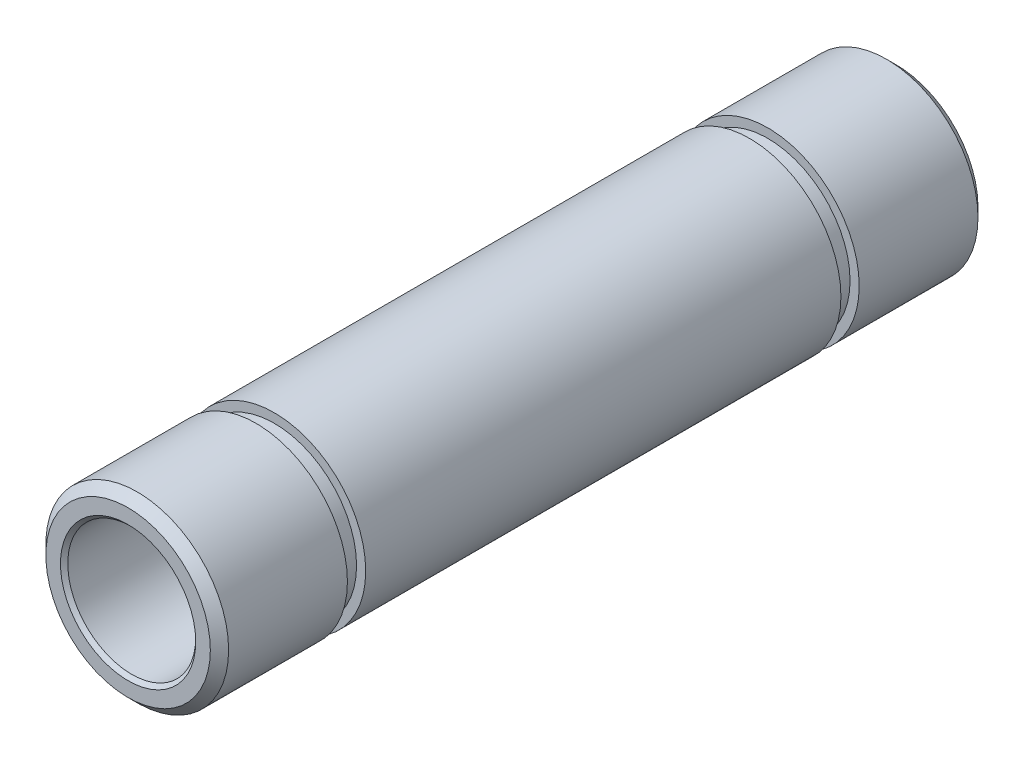
ISO-10303-21;
HEADER;
FILE_DESCRIPTION(('STEP AP214'),'2;1');
FILE_NAME('part.step','',(''),(''),'','','');
FILE_SCHEMA(('AUTOMOTIVE_DESIGN { 1 0 10303 214 1 1 1 1 }'));
ENDSEC;
DATA;
#1=APPLICATION_CONTEXT('core data for automotive mechanical design processes');
#2=APPLICATION_PROTOCOL_DEFINITION('international standard','automotive_design',2000,#1);
#3=PRODUCT_CONTEXT('',#1,'mechanical');
#4=PRODUCT('Part','Part','',(#3));
#5=PRODUCT_RELATED_PRODUCT_CATEGORY('part','',(#4));
#6=PRODUCT_DEFINITION_FORMATION('','',#4);
#7=PRODUCT_DEFINITION_CONTEXT('part definition',#1,'design');
#8=PRODUCT_DEFINITION('design','',#6,#7);
#9=PRODUCT_DEFINITION_SHAPE('','',#8);
#10=(LENGTH_UNIT() NAMED_UNIT(*) SI_UNIT(.MILLI.,.METRE.));
#11=(NAMED_UNIT(*) PLANE_ANGLE_UNIT() SI_UNIT($,.RADIAN.));
#12=(NAMED_UNIT(*) SI_UNIT($,.STERADIAN.) SOLID_ANGLE_UNIT());
#13=UNCERTAINTY_MEASURE_WITH_UNIT(LENGTH_MEASURE(1.E-05),#10,'distance_accuracy_value','');
#14=(GEOMETRIC_REPRESENTATION_CONTEXT(3) GLOBAL_UNCERTAINTY_ASSIGNED_CONTEXT((#13)) GLOBAL_UNIT_ASSIGNED_CONTEXT((#10,
#11,#12)) REPRESENTATION_CONTEXT('',''));
#15=CARTESIAN_POINT('',(0.,0.,0.));
#16=DIRECTION('',(0.,0.,1.));
#17=DIRECTION('',(1.,0.,0.));
#18=AXIS2_PLACEMENT_3D('',#15,#16,#17);
#19=CARTESIAN_POINT('',(0.,0.,-42.));
#20=DIRECTION('',(0.,0.,1.));
#21=DIRECTION('',(1.,0.,0.));
#22=AXIS2_PLACEMENT_3D('',#19,#20,#21);
#23=CYLINDRICAL_SURFACE('',#22,5.);
#24=CARTESIAN_POINT('',(0.,0.,-41.5));
#25=DIRECTION('',(0.,0.,1.));
#26=DIRECTION('',(1.,0.,0.));
#27=AXIS2_PLACEMENT_3D('',#24,#25,#26);
#28=CIRCLE('',#27,5.);
#29=CARTESIAN_POINT('',(5.,0.,-41.5));
#30=VERTEX_POINT('',#29);
#31=EDGE_CURVE('E36',#30,#30,#28,.T.);
#32=ORIENTED_EDGE('',*,*,#31,.T.);
#33=EDGE_LOOP('',(#32));
#34=FACE_BOUND('',#33,.T.);
#35=CARTESIAN_POINT('',(0.,0.,-35.));
#36=DIRECTION('',(0.,0.,1.));
#37=DIRECTION('',(1.,0.,0.));
#38=AXIS2_PLACEMENT_3D('',#35,#36,#37);
#39=CIRCLE('',#38,5.);
#40=CARTESIAN_POINT('',(5.,0.,-35.));
#41=VERTEX_POINT('',#40);
#42=EDGE_CURVE('E58',#41,#41,#39,.T.);
#43=ORIENTED_EDGE('',*,*,#42,.F.);
#44=EDGE_LOOP('',(#43));
#45=FACE_BOUND('',#44,.T.);
#46=ADVANCED_FACE('F13',(#34,#45),#23,.T.);
#47=CARTESIAN_POINT('',(0.,0.,-34.));
#48=DIRECTION('',(0.,0.,1.));
#49=DIRECTION('',(1.,0.,0.));
#50=AXIS2_PLACEMENT_3D('',#47,#48,#49);
#51=CIRCLE('',#50,5.);
#52=CARTESIAN_POINT('',(5.,0.,-34.));
#53=VERTEX_POINT('',#52);
#54=EDGE_CURVE('E55',#53,#53,#51,.T.);
#55=ORIENTED_EDGE('',*,*,#54,.T.);
#56=EDGE_LOOP('',(#55));
#57=FACE_BOUND('',#56,.T.);
#58=CARTESIAN_POINT('',(0.,0.,-8.));
#59=DIRECTION('',(0.,0.,1.));
#60=DIRECTION('',(1.,0.,0.));
#61=AXIS2_PLACEMENT_3D('',#58,#59,#60);
#62=CIRCLE('',#61,5.);
#63=CARTESIAN_POINT('',(5.,0.,-8.));
#64=VERTEX_POINT('',#63);
#65=EDGE_CURVE('E45',#64,#64,#62,.T.);
#66=ORIENTED_EDGE('',*,*,#65,.F.);
#67=EDGE_LOOP('',(#66));
#68=FACE_BOUND('',#67,.T.);
#69=ADVANCED_FACE('F92',(#57,#68),#23,.T.);
#70=CARTESIAN_POINT('',(0.,0.,-0.5));
#71=DIRECTION('',(0.,0.,1.));
#72=DIRECTION('',(1.,0.,0.));
#73=AXIS2_PLACEMENT_3D('',#70,#71,#72);
#74=CIRCLE('',#73,5.);
#75=CARTESIAN_POINT('',(5.,0.,-0.5));
#76=VERTEX_POINT('',#75);
#77=EDGE_CURVE('E39',#76,#76,#74,.F.);
#78=ORIENTED_EDGE('',*,*,#77,.T.);
#79=EDGE_LOOP('',(#78));
#80=FACE_BOUND('',#79,.T.);
#81=CARTESIAN_POINT('',(0.,0.,-7.));
#82=DIRECTION('',(0.,0.,1.));
#83=DIRECTION('',(1.,0.,0.));
#84=AXIS2_PLACEMENT_3D('',#81,#82,#83);
#85=CIRCLE('',#84,5.);
#86=CARTESIAN_POINT('',(5.,0.,-7.));
#87=VERTEX_POINT('',#86);
#88=EDGE_CURVE('E46',#87,#87,#85,.T.);
#89=ORIENTED_EDGE('',*,*,#88,.T.);
#90=EDGE_LOOP('',(#89));
#91=FACE_BOUND('',#90,.T.);
#92=ADVANCED_FACE('F95',(#80,#91),#23,.T.);
#93=CARTESIAN_POINT('',(0.,0.,-42.));
#94=DIRECTION('',(0.,0.,1.));
#95=DIRECTION('',(1.,0.,0.));
#96=AXIS2_PLACEMENT_3D('',#93,#94,#95);
#97=PLANE('',#96);
#98=CARTESIAN_POINT('',(0.,0.,-42.));
#99=DIRECTION('',(0.,0.,1.));
#100=DIRECTION('',(1.,0.,0.));
#101=AXIS2_PLACEMENT_3D('',#98,#99,#100);
#102=CIRCLE('',#101,3.69999999999997);
#103=CARTESIAN_POINT('',(3.69999999999997,0.,-42.));
#104=VERTEX_POINT('',#103);
#105=EDGE_CURVE('E20',#104,#104,#102,.T.);
#106=ORIENTED_EDGE('',*,*,#105,.T.);
#107=EDGE_LOOP('',(#106));
#108=FACE_BOUND('',#107,.T.);
#109=CARTESIAN_POINT('',(0.,0.,-42.));
#110=DIRECTION('',(0.,0.,1.));
#111=DIRECTION('',(1.,0.,0.));
#112=AXIS2_PLACEMENT_3D('',#109,#110,#111);
#113=CIRCLE('',#112,4.49999999999997);
#114=CARTESIAN_POINT('',(4.49999999999997,0.,-42.));
#115=VERTEX_POINT('',#114);
#116=EDGE_CURVE('E33',#115,#115,#113,.F.);
#117=ORIENTED_EDGE('',*,*,#116,.T.);
#118=EDGE_LOOP('',(#117));
#119=FACE_BOUND('',#118,.T.);
#120=ADVANCED_FACE('F104',(#108,#119),#97,.F.);
#121=CARTESIAN_POINT('',(0.,0.,0.));
#122=DIRECTION('',(0.,0.,1.));
#123=DIRECTION('',(1.,0.,0.));
#124=AXIS2_PLACEMENT_3D('',#121,#122,#123);
#125=PLANE('',#124);
#126=CARTESIAN_POINT('',(0.,0.,0.));
#127=DIRECTION('',(0.,0.,1.));
#128=DIRECTION('',(1.,0.,0.));
#129=AXIS2_PLACEMENT_3D('',#126,#127,#128);
#130=CIRCLE('',#129,3.70000000000003);
#131=CARTESIAN_POINT('',(3.70000000000003,0.,0.));
#132=VERTEX_POINT('',#131);
#133=EDGE_CURVE('E24',#132,#132,#130,.F.);
#134=ORIENTED_EDGE('',*,*,#133,.T.);
#135=EDGE_LOOP('',(#134));
#136=FACE_BOUND('',#135,.T.);
#137=CARTESIAN_POINT('',(0.,0.,0.));
#138=DIRECTION('',(0.,0.,1.));
#139=DIRECTION('',(1.,0.,0.));
#140=AXIS2_PLACEMENT_3D('',#137,#138,#139);
#141=CIRCLE('',#140,4.5);
#142=CARTESIAN_POINT('',(4.5,0.,0.));
#143=VERTEX_POINT('',#142);
#144=EDGE_CURVE('E42',#143,#143,#141,.T.);
#145=ORIENTED_EDGE('',*,*,#144,.T.);
#146=EDGE_LOOP('',(#145));
#147=FACE_BOUND('',#146,.T.);
#148=ADVANCED_FACE('F109',(#136,#147),#125,.T.);
#149=CARTESIAN_POINT('',(0.,0.,-42.));
#150=DIRECTION('',(0.,0.,1.));
#151=DIRECTION('',(1.,0.,0.));
#152=AXIS2_PLACEMENT_3D('',#149,#150,#151);
#153=CYLINDRICAL_SURFACE('',#152,3.5);
#154=CARTESIAN_POINT('',(0.,0.,-41.8));
#155=DIRECTION('',(0.,0.,1.));
#156=DIRECTION('',(1.,0.,0.));
#157=AXIS2_PLACEMENT_3D('',#154,#155,#156);
#158=CIRCLE('',#157,3.5);
#159=CARTESIAN_POINT('',(3.5,0.,-41.8));
#160=VERTEX_POINT('',#159);
#161=EDGE_CURVE('E9',#160,#160,#158,.F.);
#162=ORIENTED_EDGE('',*,*,#161,.T.);
#163=EDGE_LOOP('',(#162));
#164=FACE_BOUND('',#163,.T.);
#165=CARTESIAN_POINT('',(0.,0.,-0.200000000000033));
#166=DIRECTION('',(0.,0.,1.));
#167=DIRECTION('',(1.,0.,0.));
#168=AXIS2_PLACEMENT_3D('',#165,#166,#167);
#169=CIRCLE('',#168,3.5);
#170=CARTESIAN_POINT('',(3.5,0.,-0.200000000000033));
#171=VERTEX_POINT('',#170);
#172=EDGE_CURVE('E28',#171,#171,#169,.T.);
#173=ORIENTED_EDGE('',*,*,#172,.T.);
#174=EDGE_LOOP('',(#173));
#175=FACE_BOUND('',#174,.T.);
#176=ADVANCED_FACE('F125',(#164,#175),#153,.F.);
#177=CARTESIAN_POINT('',(0.,0.,-8.));
#178=DIRECTION('',(0.,0.,1.));
#179=DIRECTION('',(1.,0.,0.));
#180=AXIS2_PLACEMENT_3D('',#177,#178,#179);
#181=PLANE('',#180);
#182=CARTESIAN_POINT('',(0.,0.,-8.));
#183=DIRECTION('',(0.,0.,1.));
#184=DIRECTION('',(1.,0.,0.));
#185=AXIS2_PLACEMENT_3D('',#182,#183,#184);
#186=CIRCLE('',#185,4.5);
#187=CARTESIAN_POINT('',(4.5,0.,-8.));
#188=VERTEX_POINT('',#187);
#189=EDGE_CURVE('E49',#188,#188,#186,.T.);
#190=ORIENTED_EDGE('',*,*,#189,.F.);
#191=EDGE_LOOP('',(#190));
#192=FACE_BOUND('',#191,.T.);
#193=ORIENTED_EDGE('',*,*,#65,.T.);
#194=EDGE_LOOP('',(#193));
#195=FACE_BOUND('',#194,.T.);
#196=ADVANCED_FACE('F117',(#192,#195),#181,.T.);
#197=CARTESIAN_POINT('',(0.,0.,-7.));
#198=DIRECTION('',(0.,0.,1.));
#199=DIRECTION('',(1.,0.,0.));
#200=AXIS2_PLACEMENT_3D('',#197,#198,#199);
#201=PLANE('',#200);
#202=CARTESIAN_POINT('',(0.,0.,-7.));
#203=DIRECTION('',(0.,0.,1.));
#204=DIRECTION('',(1.,0.,0.));
#205=AXIS2_PLACEMENT_3D('',#202,#203,#204);
#206=CIRCLE('',#205,4.5);
#207=CARTESIAN_POINT('',(4.5,0.,-7.));
#208=VERTEX_POINT('',#207);
#209=EDGE_CURVE('E52',#208,#208,#206,.T.);
#210=ORIENTED_EDGE('',*,*,#209,.T.);
#211=EDGE_LOOP('',(#210));
#212=FACE_BOUND('',#211,.T.);
#213=ORIENTED_EDGE('',*,*,#88,.F.);
#214=EDGE_LOOP('',(#213));
#215=FACE_BOUND('',#214,.T.);
#216=ADVANCED_FACE('F115',(#212,#215),#201,.F.);
#217=CARTESIAN_POINT('',(0.,0.,-8.));
#218=DIRECTION('',(0.,0.,1.));
#219=DIRECTION('',(1.,0.,0.));
#220=AXIS2_PLACEMENT_3D('',#217,#218,#219);
#221=CYLINDRICAL_SURFACE('',#220,4.5);
#222=ORIENTED_EDGE('',*,*,#189,.T.);
#223=EDGE_LOOP('',(#222));
#224=FACE_BOUND('',#223,.T.);
#225=ORIENTED_EDGE('',*,*,#209,.F.);
#226=EDGE_LOOP('',(#225));
#227=FACE_BOUND('',#226,.T.);
#228=ADVANCED_FACE('F87',(#224,#227),#221,.T.);
#229=CARTESIAN_POINT('',(0.,0.,-34.));
#230=DIRECTION('',(0.,0.,1.));
#231=DIRECTION('',(1.,0.,0.));
#232=AXIS2_PLACEMENT_3D('',#229,#230,#231);
#233=PLANE('',#232);
#234=ORIENTED_EDGE('',*,*,#54,.F.);
#235=EDGE_LOOP('',(#234));
#236=FACE_BOUND('',#235,.T.);
#237=CARTESIAN_POINT('',(0.,0.,-34.));
#238=DIRECTION('',(0.,0.,1.));
#239=DIRECTION('',(1.,0.,0.));
#240=AXIS2_PLACEMENT_3D('',#237,#238,#239);
#241=CIRCLE('',#240,4.5);
#242=CARTESIAN_POINT('',(4.5,0.,-34.));
#243=VERTEX_POINT('',#242);
#244=EDGE_CURVE('E61',#243,#243,#241,.T.);
#245=ORIENTED_EDGE('',*,*,#244,.T.);
#246=EDGE_LOOP('',(#245));
#247=FACE_BOUND('',#246,.T.);
#248=ADVANCED_FACE('F70',(#236,#247),#233,.F.);
#249=CARTESIAN_POINT('',(0.,0.,-35.));
#250=DIRECTION('',(0.,0.,1.));
#251=DIRECTION('',(1.,0.,0.));
#252=AXIS2_PLACEMENT_3D('',#249,#250,#251);
#253=PLANE('',#252);
#254=ORIENTED_EDGE('',*,*,#42,.T.);
#255=EDGE_LOOP('',(#254));
#256=FACE_BOUND('',#255,.T.);
#257=CARTESIAN_POINT('',(0.,0.,-35.));
#258=DIRECTION('',(0.,0.,1.));
#259=DIRECTION('',(1.,0.,0.));
#260=AXIS2_PLACEMENT_3D('',#257,#258,#259);
#261=CIRCLE('',#260,4.5);
#262=CARTESIAN_POINT('',(4.5,0.,-35.));
#263=VERTEX_POINT('',#262);
#264=EDGE_CURVE('E64',#263,#263,#261,.T.);
#265=ORIENTED_EDGE('',*,*,#264,.F.);
#266=EDGE_LOOP('',(#265));
#267=FACE_BOUND('',#266,.T.);
#268=ADVANCED_FACE('F76',(#256,#267),#253,.T.);
#269=CARTESIAN_POINT('',(0.,0.,-34.));
#270=DIRECTION('',(0.,0.,-1.));
#271=DIRECTION('',(-1.,0.,0.));
#272=AXIS2_PLACEMENT_3D('',#269,#270,#271);
#273=CYLINDRICAL_SURFACE('',#272,4.5);
#274=ORIENTED_EDGE('',*,*,#244,.F.);
#275=EDGE_LOOP('',(#274));
#276=FACE_BOUND('',#275,.T.);
#277=ORIENTED_EDGE('',*,*,#264,.T.);
#278=EDGE_LOOP('',(#277));
#279=FACE_BOUND('',#278,.T.);
#280=ADVANCED_FACE('F72',(#276,#279),#273,.T.);
#281=CARTESIAN_POINT('',(0.,0.,0.));
#282=DIRECTION('',(0.,0.,-1.));
#283=DIRECTION('',(-1.,0.,0.));
#284=AXIS2_PLACEMENT_3D('',#281,#282,#283);
#285=CONICAL_SURFACE('',#284,4.5,0.785398163397451);
#286=ORIENTED_EDGE('',*,*,#77,.F.);
#287=EDGE_LOOP('',(#286));
#288=FACE_BOUND('',#287,.T.);
#289=ORIENTED_EDGE('',*,*,#144,.F.);
#290=EDGE_LOOP('',(#289));
#291=FACE_BOUND('',#290,.T.);
#292=ADVANCED_FACE('F75',(#288,#291),#285,.T.);
#293=CARTESIAN_POINT('',(0.,0.,-41.5));
#294=DIRECTION('',(0.,0.,1.));
#295=DIRECTION('',(1.,0.,0.));
#296=AXIS2_PLACEMENT_3D('',#293,#294,#295);
#297=CONICAL_SURFACE('',#296,5.,0.785398163397451);
#298=ORIENTED_EDGE('',*,*,#116,.F.);
#299=EDGE_LOOP('',(#298));
#300=FACE_BOUND('',#299,.T.);
#301=ORIENTED_EDGE('',*,*,#31,.F.);
#302=EDGE_LOOP('',(#301));
#303=FACE_BOUND('',#302,.T.);
#304=ADVANCED_FACE('F139',(#300,#303),#297,.T.);
#305=CARTESIAN_POINT('',(0.,0.,-0.200000000000027));
#306=DIRECTION('',(0.,0.,1.));
#307=DIRECTION('',(1.,0.,0.));
#308=AXIS2_PLACEMENT_3D('',#305,#306,#307);
#309=CONICAL_SURFACE('',#308,3.5,0.785398163397455);
#310=ORIENTED_EDGE('',*,*,#133,.F.);
#311=EDGE_LOOP('',(#310));
#312=FACE_BOUND('',#311,.T.);
#313=ORIENTED_EDGE('',*,*,#172,.F.);
#314=EDGE_LOOP('',(#313));
#315=FACE_BOUND('',#314,.T.);
#316=ADVANCED_FACE('F144',(#312,#315),#309,.F.);
#317=CARTESIAN_POINT('',(0.,0.,-42.));
#318=DIRECTION('',(0.,0.,-1.));
#319=DIRECTION('',(-1.,0.,0.));
#320=AXIS2_PLACEMENT_3D('',#317,#318,#319);
#321=CONICAL_SURFACE('',#320,3.69999999999997,0.785398163397455);
#322=ORIENTED_EDGE('',*,*,#161,.F.);
#323=EDGE_LOOP('',(#322));
#324=FACE_BOUND('',#323,.T.);
#325=ORIENTED_EDGE('',*,*,#105,.F.);
#326=EDGE_LOOP('',(#325));
#327=FACE_BOUND('',#326,.T.);
#328=ADVANCED_FACE('F15',(#324,#327),#321,.F.);
#329=CLOSED_SHELL('',(#46,#69,#92,#120,#148,#176,#196,#216,#228,#248,#268,#280,#292,#304,#316,#328));
#330=MANIFOLD_SOLID_BREP('B1',#329);
#331=ADVANCED_BREP_SHAPE_REPRESENTATION('',(#18,#330),#14);
#332=SHAPE_DEFINITION_REPRESENTATION(#9,#331);
ENDSEC;
END-ISO-10303-21;
